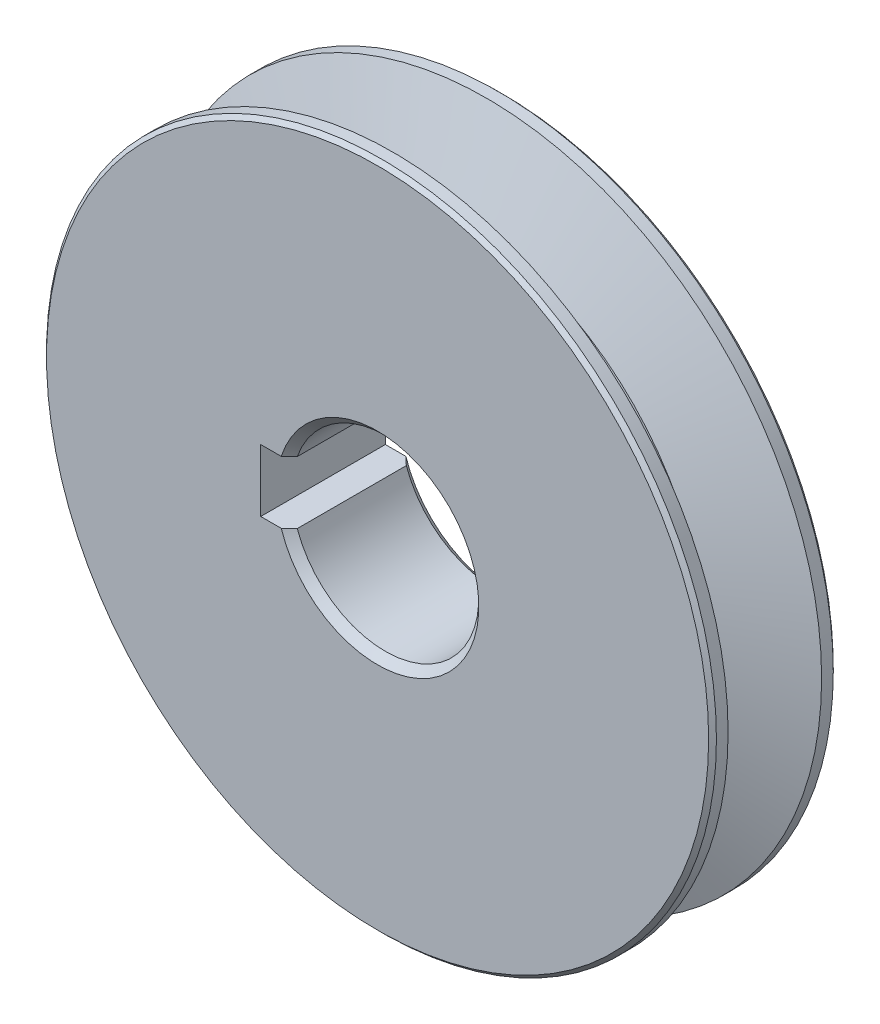
ISO-10303-21;
HEADER;
FILE_DESCRIPTION(('STEP AP214'),'2;1');
FILE_NAME('part.step','',(''),(''),'','','');
FILE_SCHEMA(('AUTOMOTIVE_DESIGN { 1 0 10303 214 1 1 1 1 }'));
ENDSEC;
DATA;
#1=APPLICATION_CONTEXT('core data for automotive mechanical design processes');
#2=APPLICATION_PROTOCOL_DEFINITION('international standard','automotive_design',2000,#1);
#3=PRODUCT_CONTEXT('',#1,'mechanical');
#4=PRODUCT('Part','Part','',(#3));
#5=PRODUCT_RELATED_PRODUCT_CATEGORY('part','',(#4));
#6=PRODUCT_DEFINITION_FORMATION('','',#4);
#7=PRODUCT_DEFINITION_CONTEXT('part definition',#1,'design');
#8=PRODUCT_DEFINITION('design','',#6,#7);
#9=PRODUCT_DEFINITION_SHAPE('','',#8);
#10=(LENGTH_UNIT() NAMED_UNIT(*) SI_UNIT(.MILLI.,.METRE.));
#11=(NAMED_UNIT(*) PLANE_ANGLE_UNIT() SI_UNIT($,.RADIAN.));
#12=(NAMED_UNIT(*) SI_UNIT($,.STERADIAN.) SOLID_ANGLE_UNIT());
#13=UNCERTAINTY_MEASURE_WITH_UNIT(LENGTH_MEASURE(1.E-05),#10,'distance_accuracy_value','');
#14=(GEOMETRIC_REPRESENTATION_CONTEXT(3) GLOBAL_UNCERTAINTY_ASSIGNED_CONTEXT((#13)) GLOBAL_UNIT_ASSIGNED_CONTEXT((#10,
#11,#12)) REPRESENTATION_CONTEXT('',''));
#15=CARTESIAN_POINT('',(0.,0.,0.));
#16=DIRECTION('',(0.,0.,1.));
#17=DIRECTION('',(1.,0.,0.));
#18=AXIS2_PLACEMENT_3D('',#15,#16,#17);
#19=CARTESIAN_POINT('',(0.0594454316027605,2.52282669934369E-12,-2.39999999999939));
#20=DIRECTION('',(0.,0.,1.));
#21=DIRECTION('',(1.,0.,0.));
#22=AXIS2_PLACEMENT_3D('',#19,#20,#21);
#23=CYLINDRICAL_SURFACE('',#22,12.9);
#24=CARTESIAN_POINT('',(0.0594454316027605,2.52282669934369E-12,-2.24999999999935));
#25=DIRECTION('',(0.,0.,-1.));
#26=DIRECTION('',(-1.,0.,0.));
#27=AXIS2_PLACEMENT_3D('',#24,#25,#26);
#28=CIRCLE('',#27,12.9);
#29=CARTESIAN_POINT('',(-12.8405545683972,2.52282669934369E-12,-2.24999999999935));
#30=VERTEX_POINT('',#29);
#31=EDGE_CURVE('E42',#30,#30,#28,.F.);
#32=ORIENTED_EDGE('',*,*,#31,.T.);
#33=EDGE_LOOP('',(#32));
#34=FACE_BOUND('',#33,.T.);
#35=CARTESIAN_POINT('',(0.0594454316027606,2.52282669934369E-12,-1.80110177307778));
#36=DIRECTION('',(0.,0.,1.));
#37=DIRECTION('',(1.,0.,0.));
#38=AXIS2_PLACEMENT_3D('',#35,#36,#37);
#39=CIRCLE('',#38,12.9);
#40=CARTESIAN_POINT('',(12.9594454316028,2.52282669934369E-12,-1.80110177307779));
#41=VERTEX_POINT('',#40);
#42=EDGE_CURVE('E120',#41,#41,#39,.T.);
#43=ORIENTED_EDGE('',*,*,#42,.F.);
#44=EDGE_LOOP('',(#43));
#45=FACE_BOUND('',#44,.T.);
#46=ADVANCED_FACE('F34',(#34,#45),#23,.T.);
#47=CARTESIAN_POINT('',(12.9594454316028,2.52282669934369E-12,-2.39999999999939));
#48=DIRECTION('',(0.,0.,-1.));
#49=DIRECTION('',(-1.,0.,0.));
#50=AXIS2_PLACEMENT_3D('',#47,#48,#49);
#51=PLANE('',#50);
#52=CARTESIAN_POINT('',(0.0594454316027605,2.52282669934369E-12,-2.39999999999939));
#53=DIRECTION('',(0.,0.,-1.));
#54=DIRECTION('',(-1.,0.,0.));
#55=AXIS2_PLACEMENT_3D('',#52,#53,#54);
#56=CIRCLE('',#55,12.75);
#57=CARTESIAN_POINT('',(-12.6905545683972,2.52282669934369E-12,-2.39999999999938));
#58=VERTEX_POINT('',#57);
#59=EDGE_CURVE('E11',#58,#58,#56,.T.);
#60=ORIENTED_EDGE('',*,*,#59,.T.);
#61=EDGE_LOOP('',(#60));
#62=FACE_BOUND('',#61,.T.);
#63=DIRECTION('',(1.,0.,0.));
#64=VECTOR('',#63,1.);
#65=CARTESIAN_POINT('',(-4.44055456839739,-1.19999999999748,-2.39999999999939));
#66=LINE('',#65,#64);
#67=CARTESIAN_POINT('',(-4.44055456839739,-1.19999999999748,-2.39999999999939));
#68=VERTEX_POINT('',#67);
#69=CARTESIAN_POINT('',(-3.65134963801083,-1.19999999999748,-2.39999999999939));
#70=VERTEX_POINT('',#69);
#71=EDGE_CURVE('E101',#68,#70,#66,.T.);
#72=ORIENTED_EDGE('',*,*,#71,.T.);
#73=CARTESIAN_POINT('',(0.0594454316026113,2.52282669934369E-12,-2.39999999999939));
#74=DIRECTION('',(0.,0.,-1.));
#75=DIRECTION('',(-1.,0.,0.));
#76=AXIS2_PLACEMENT_3D('',#73,#74,#75);
#77=CIRCLE('',#76,3.90000000623942);
#78=CARTESIAN_POINT('',(-3.65134963810726,1.19999999970432,-2.39999999999939));
#79=VERTEX_POINT('',#78);
#80=EDGE_CURVE('E180',#70,#79,#77,.F.);
#81=ORIENTED_EDGE('',*,*,#80,.T.);
#82=DIRECTION('',(-1.,0.,0.));
#83=VECTOR('',#82,1.);
#84=CARTESIAN_POINT('',(-3.33466711819825,1.19999999970432,-2.39999999999939));
#85=LINE('',#84,#83);
#86=CARTESIAN_POINT('',(-4.44055456839739,1.19999999970432,-2.39999999999939));
#87=VERTEX_POINT('',#86);
#88=EDGE_CURVE('E99',#79,#87,#85,.T.);
#89=ORIENTED_EDGE('',*,*,#88,.T.);
#90=DIRECTION('',(0.,-1.,0.));
#91=VECTOR('',#90,1.);
#92=CARTESIAN_POINT('',(-4.44055456839739,1.19999999970432,-2.39999999999939));
#93=LINE('',#92,#91);
#94=EDGE_CURVE('E95',#87,#68,#93,.T.);
#95=ORIENTED_EDGE('',*,*,#94,.T.);
#96=EDGE_LOOP('',(#72,#81,#89,#95));
#97=FACE_BOUND('',#96,.T.);
#98=ADVANCED_FACE('F107',(#62,#97),#51,.T.);
#99=CARTESIAN_POINT('',(0.0594454316027611,2.52282669934369E-12,2.40000000000061));
#100=DIRECTION('',(0.,0.,1.));
#101=DIRECTION('',(1.,0.,0.));
#102=AXIS2_PLACEMENT_3D('',#99,#100,#101);
#103=PLANE('',#102);
#104=CARTESIAN_POINT('',(0.0594454316027611,2.52282669934369E-12,2.40000000000061));
#105=DIRECTION('',(0.,0.,1.));
#106=DIRECTION('',(1.,0.,0.));
#107=AXIS2_PLACEMENT_3D('',#104,#105,#106);
#108=CIRCLE('',#107,12.75);
#109=CARTESIAN_POINT('',(12.8094454316027,2.52282669934369E-12,2.40000000000061));
#110=VERTEX_POINT('',#109);
#111=EDGE_CURVE('E327',#110,#110,#108,.T.);
#112=ORIENTED_EDGE('',*,*,#111,.T.);
#113=EDGE_LOOP('',(#112));
#114=FACE_BOUND('',#113,.T.);
#115=DIRECTION('',(-1.,0.,0.));
#116=VECTOR('',#115,1.);
#117=CARTESIAN_POINT('',(-3.33466711819825,1.19999999970432,2.40000000000061));
#118=LINE('',#117,#116);
#119=CARTESIAN_POINT('',(-3.65134963729901,1.19999999970432,2.40000000000061));
#120=VERTEX_POINT('',#119);
#121=CARTESIAN_POINT('',(-4.44055456839739,1.19999999970432,2.40000000000061));
#122=VERTEX_POINT('',#121);
#123=EDGE_CURVE('E110',#120,#122,#118,.T.);
#124=ORIENTED_EDGE('',*,*,#123,.F.);
#125=CARTESIAN_POINT('',(0.0594454316026113,2.52282669934369E-12,2.40000000000061));
#126=DIRECTION('',(0.,0.,1.));
#127=DIRECTION('',(1.,0.,0.));
#128=AXIS2_PLACEMENT_3D('',#125,#126,#127);
#129=CIRCLE('',#128,3.90000000547037);
#130=CARTESIAN_POINT('',(-3.65134963720257,-1.19999999999748,2.40000000000061));
#131=VERTEX_POINT('',#130);
#132=EDGE_CURVE('E57',#120,#131,#129,.F.);
#133=ORIENTED_EDGE('',*,*,#132,.T.);
#134=DIRECTION('',(1.,0.,0.));
#135=VECTOR('',#134,1.);
#136=CARTESIAN_POINT('',(-4.44055456839739,-1.19999999999748,2.40000000000061));
#137=LINE('',#136,#135);
#138=CARTESIAN_POINT('',(-4.44055456839739,-1.19999999999748,2.40000000000062));
#139=VERTEX_POINT('',#138);
#140=EDGE_CURVE('E112',#139,#131,#137,.T.);
#141=ORIENTED_EDGE('',*,*,#140,.F.);
#142=DIRECTION('',(0.,-1.,0.));
#143=VECTOR('',#142,1.);
#144=CARTESIAN_POINT('',(-4.44055456839739,1.19999999970432,2.40000000000061));
#145=LINE('',#144,#143);
#146=EDGE_CURVE('E97',#122,#139,#145,.T.);
#147=ORIENTED_EDGE('',*,*,#146,.F.);
#148=EDGE_LOOP('',(#124,#133,#141,#147));
#149=FACE_BOUND('',#148,.T.);
#150=ADVANCED_FACE('F193',(#114,#149),#103,.T.);
#151=CARTESIAN_POINT('',(0.0594454316027605,2.52282669934369E-12,-2.39999999999939));
#152=DIRECTION('',(0.,0.,1.));
#153=DIRECTION('',(1.,0.,0.));
#154=AXIS2_PLACEMENT_3D('',#151,#152,#153);
#155=CYLINDRICAL_SURFACE('',#154,12.9);
#156=CARTESIAN_POINT('',(0.0594454316027611,2.52282669934369E-12,2.25000000000063));
#157=DIRECTION('',(0.,0.,1.));
#158=DIRECTION('',(1.,0.,0.));
#159=AXIS2_PLACEMENT_3D('',#156,#157,#158);
#160=CIRCLE('',#159,12.9);
#161=CARTESIAN_POINT('',(12.9594454316028,2.52282669934369E-12,2.25000000000063));
#162=VERTEX_POINT('',#161);
#163=EDGE_CURVE('E325',#162,#162,#160,.F.);
#164=ORIENTED_EDGE('',*,*,#163,.T.);
#165=EDGE_LOOP('',(#164));
#166=FACE_BOUND('',#165,.T.);
#167=CARTESIAN_POINT('',(0.059445431602761,2.52282669934369E-12,1.80110177307902));
#168=DIRECTION('',(0.,0.,1.));
#169=DIRECTION('',(1.,0.,0.));
#170=AXIS2_PLACEMENT_3D('',#167,#168,#169);
#171=CIRCLE('',#170,12.9);
#172=CARTESIAN_POINT('',(12.9594454316028,2.52282669934369E-12,1.80110177307901));
#173=VERTEX_POINT('',#172);
#174=EDGE_CURVE('E134',#173,#173,#171,.T.);
#175=ORIENTED_EDGE('',*,*,#174,.T.);
#176=EDGE_LOOP('',(#175));
#177=FACE_BOUND('',#176,.T.);
#178=ADVANCED_FACE('F197',(#166,#177),#155,.T.);
#179=CARTESIAN_POINT('',(0.059445431602761,2.52282669934369E-12,1.80110177307902));
#180=DIRECTION('',(0.,0.,1.));
#181=DIRECTION('',(1.,0.,0.));
#182=AXIS2_PLACEMENT_3D('',#179,#180,#181);
#183=CONICAL_SURFACE('',#182,12.9,1.22173047639594);
#184=CARTESIAN_POINT('',(0.0594454316027609,2.52282669934369E-12,0.600000000000205));
#185=DIRECTION('',(0.,0.,1.));
#186=DIRECTION('',(1.,0.,0.));
#187=AXIS2_PLACEMENT_3D('',#184,#185,#186);
#188=CIRCLE('',#187,9.6);
#189=CARTESIAN_POINT('',(9.65944543160276,2.52282669934369E-12,0.600000000000203));
#190=VERTEX_POINT('',#189);
#191=EDGE_CURVE('E131',#190,#190,#188,.T.);
#192=ORIENTED_EDGE('',*,*,#191,.T.);
#193=EDGE_LOOP('',(#192));
#194=FACE_BOUND('',#193,.T.);
#195=ORIENTED_EDGE('',*,*,#174,.F.);
#196=EDGE_LOOP('',(#195));
#197=FACE_BOUND('',#196,.T.);
#198=ADVANCED_FACE('F201',(#194,#197),#183,.T.);
#199=CARTESIAN_POINT('',(0.0594454316027605,2.52282669934369E-12,-2.39999999999939));
#200=DIRECTION('',(0.,0.,1.));
#201=DIRECTION('',(1.,0.,0.));
#202=AXIS2_PLACEMENT_3D('',#199,#200,#201);
#203=CYLINDRICAL_SURFACE('',#202,9.6);
#204=CARTESIAN_POINT('',(0.0594454316027607,2.52282669934369E-12,-0.599999999999384));
#205=DIRECTION('',(0.,0.,1.));
#206=DIRECTION('',(1.,0.,0.));
#207=AXIS2_PLACEMENT_3D('',#204,#205,#206);
#208=CIRCLE('',#207,9.6);
#209=CARTESIAN_POINT('',(9.65944543160276,2.52282669934369E-12,-0.599999999999386));
#210=VERTEX_POINT('',#209);
#211=EDGE_CURVE('E128',#210,#210,#208,.T.);
#212=ORIENTED_EDGE('',*,*,#211,.T.);
#213=EDGE_LOOP('',(#212));
#214=FACE_BOUND('',#213,.T.);
#215=ORIENTED_EDGE('',*,*,#191,.F.);
#216=EDGE_LOOP('',(#215));
#217=FACE_BOUND('',#216,.T.);
#218=ADVANCED_FACE('F205',(#214,#217),#203,.T.);
#219=CARTESIAN_POINT('',(0.0594454316027607,2.52282669934369E-12,-0.599999999999384));
#220=DIRECTION('',(0.,0.,-1.));
#221=DIRECTION('',(-1.,0.,0.));
#222=AXIS2_PLACEMENT_3D('',#219,#220,#221);
#223=CONICAL_SURFACE('',#222,9.6,1.22173047639605);
#224=ORIENTED_EDGE('',*,*,#42,.T.);
#225=EDGE_LOOP('',(#224));
#226=FACE_BOUND('',#225,.T.);
#227=ORIENTED_EDGE('',*,*,#211,.F.);
#228=EDGE_LOOP('',(#227));
#229=FACE_BOUND('',#228,.T.);
#230=ADVANCED_FACE('F208',(#226,#229),#223,.T.);
#231=CARTESIAN_POINT('',(-4.44055456839739,1.19999999970432,-2.39999999999939));
#232=DIRECTION('',(-1.,0.,0.));
#233=DIRECTION('',(0.,0.,1.));
#234=AXIS2_PLACEMENT_3D('',#231,#232,#233);
#235=PLANE('',#234);
#236=ORIENTED_EDGE('',*,*,#146,.T.);
#237=DIRECTION('',(0.,0.,1.));
#238=VECTOR('',#237,1.);
#239=CARTESIAN_POINT('',(-4.44055456839739,-1.19999999999748,-2.39999999999939));
#240=LINE('',#239,#238);
#241=EDGE_CURVE('E91',#68,#139,#240,.T.);
#242=ORIENTED_EDGE('',*,*,#241,.F.);
#243=ORIENTED_EDGE('',*,*,#94,.F.);
#244=DIRECTION('',(0.,0.,1.));
#245=VECTOR('',#244,1.);
#246=CARTESIAN_POINT('',(-4.44055456839739,1.19999999970432,-2.39999999999939));
#247=LINE('',#246,#245);
#248=EDGE_CURVE('E118',#87,#122,#247,.T.);
#249=ORIENTED_EDGE('',*,*,#248,.T.);
#250=EDGE_LOOP('',(#236,#242,#243,#249));
#251=FACE_BOUND('',#250,.T.);
#252=ADVANCED_FACE('F92',(#251),#235,.F.);
#253=CARTESIAN_POINT('',(-3.33466711819825,1.19999999970432,-2.39999999999939));
#254=DIRECTION('',(0.,1.,0.));
#255=DIRECTION('',(0.,0.,1.));
#256=AXIS2_PLACEMENT_3D('',#253,#254,#255);
#257=PLANE('',#256);
#258=DIRECTION('',(0.,0.,1.));
#259=VECTOR('',#258,1.);
#260=CARTESIAN_POINT('',(-3.33466711819825,1.19999999970432,-2.39999999999939));
#261=LINE('',#260,#259);
#262=CARTESIAN_POINT('',(-3.33466711819825,1.19999999970432,-2.09999999452902));
#263=VERTEX_POINT('',#262);
#264=CARTESIAN_POINT('',(-3.33466711819825,1.19999999970432,2.0999999937612));
#265=VERTEX_POINT('',#264);
#266=EDGE_CURVE('E121',#263,#265,#261,.T.);
#267=ORIENTED_EDGE('',*,*,#266,.T.);
#268=CARTESIAN_POINT('',(-3.33466711819825,1.19999999970432,2.0999999937612));
#269=CARTESIAN_POINT('',(-3.38756168295526,1.19999999970432,2.14987950799116));
#270=CARTESIAN_POINT('',(-3.44039917663128,1.19999999970432,2.19981926693219));
#271=CARTESIAN_POINT('',(-3.54596001631963,1.19999999970432,2.29981926902455));
#272=CARTESIAN_POINT('',(-3.59868336234387,1.19999999970432,2.34987951216333));
#273=CARTESIAN_POINT('',(-3.65134963729901,1.19999999970432,2.40000000000062));
#274=B_SPLINE_CURVE_WITH_KNOTS('',3,(#268,#269,#270,#271,#272,#273),.UNSPECIFIED.,.F.,.F.,(4,2,
4),(0.,0.218110115192896,0.436220207650685),.UNSPECIFIED.);
#275=EDGE_CURVE('E149',#265,#120,#274,.T.);
#276=ORIENTED_EDGE('',*,*,#275,.T.);
#277=ORIENTED_EDGE('',*,*,#123,.T.);
#278=ORIENTED_EDGE('',*,*,#248,.F.);
#279=ORIENTED_EDGE('',*,*,#88,.F.);
#280=CARTESIAN_POINT('',(-3.65134963810726,1.19999999970432,-2.39999999999939));
#281=CARTESIAN_POINT('',(-3.59868336301735,1.19999999970432,-2.34987951228973));
#282=CARTESIAN_POINT('',(-3.54596001685837,1.19999999970432,-2.29981926927886));
#283=CARTESIAN_POINT('',(-3.44039917690059,1.19999999970432,-2.19981926744284));
#284=CARTESIAN_POINT('',(-3.3875616830899,1.19999999970432,-2.14987950863026));
#285=CARTESIAN_POINT('',(-3.33466711819825,1.19999999970432,-2.09999999452902));
#286=B_SPLINE_CURVE_WITH_KNOTS('',3,(#280,#281,#282,#283,#284,#285),.UNSPECIFIED.,.F.,.F.,(4,2,
4),(0.,0.218110092486728,0.436220207708565),.UNSPECIFIED.);
#287=EDGE_CURVE('E142',#79,#263,#286,.T.);
#288=ORIENTED_EDGE('',*,*,#287,.T.);
#289=EDGE_LOOP('',(#267,#276,#277,#278,#279,#288));
#290=FACE_BOUND('',#289,.T.);
#291=ADVANCED_FACE('F157',(#290),#257,.F.);
#292=CARTESIAN_POINT('',(-4.44055456839739,-1.19999999999748,-2.39999999999939));
#293=DIRECTION('',(0.,-1.,0.));
#294=DIRECTION('',(0.,0.,-1.));
#295=AXIS2_PLACEMENT_3D('',#292,#293,#294);
#296=PLANE('',#295);
#297=ORIENTED_EDGE('',*,*,#140,.T.);
#298=CARTESIAN_POINT('',(-3.65134963720257,-1.19999999999748,2.40000000000062));
#299=CARTESIAN_POINT('',(-3.598683362246,-1.19999999999748,2.34987951216326));
#300=CARTESIAN_POINT('',(-3.54596001622029,-1.19999999999748,2.29981926902445));
#301=CARTESIAN_POINT('',(-3.44039917652894,-1.19999999999748,2.19981926693208));
#302=CARTESIAN_POINT('',(-3.3875616828514,-1.19999999999748,2.14987950799109));
#303=CARTESIAN_POINT('',(-3.33466711809282,-1.19999999999748,2.0999999937612));
#304=B_SPLINE_CURVE_WITH_KNOTS('',3,(#298,#299,#300,#301,#302,#303),.UNSPECIFIED.,.F.,.F.,(4,2,
4),(0.,0.218110092461055,0.436220207657217),.UNSPECIFIED.);
#305=CARTESIAN_POINT('',(-3.33466711809282,-1.19999999999748,2.0999999937612));
#306=VERTEX_POINT('',#305);
#307=EDGE_CURVE('E175',#131,#306,#304,.T.);
#308=ORIENTED_EDGE('',*,*,#307,.T.);
#309=DIRECTION('',(0.,0.,1.));
#310=VECTOR('',#309,1.);
#311=CARTESIAN_POINT('',(-3.33466711809282,-1.19999999999748,-2.39999999999939));
#312=LINE('',#311,#310);
#313=CARTESIAN_POINT('',(-3.33466711809282,-1.19999999999748,-2.09999999452902));
#314=VERTEX_POINT('',#313);
#315=EDGE_CURVE('E98',#314,#306,#312,.T.);
#316=ORIENTED_EDGE('',*,*,#315,.F.);
#317=CARTESIAN_POINT('',(-3.33466711809282,-1.19999999999748,-2.09999999452902));
#318=CARTESIAN_POINT('',(-3.38756168298604,-1.19999999999748,-2.14987950863018));
#319=CARTESIAN_POINT('',(-3.44039917679826,-1.19999999999748,-2.19981926744273));
#320=CARTESIAN_POINT('',(-3.54596001675903,-1.19999999999748,-2.29981926927875));
#321=CARTESIAN_POINT('',(-3.59868336291948,-1.19999999999748,-2.34987951228966));
#322=CARTESIAN_POINT('',(-3.65134963801083,-1.19999999999748,-2.39999999999939));
#323=B_SPLINE_CURVE_WITH_KNOTS('',3,(#317,#318,#319,#320,#321,#322),.UNSPECIFIED.,.F.,.F.,(4,2,
4),(0.,0.218110115225102,0.436220207715097),.UNSPECIFIED.);
#324=EDGE_CURVE('E49',#314,#70,#323,.T.);
#325=ORIENTED_EDGE('',*,*,#324,.T.);
#326=ORIENTED_EDGE('',*,*,#71,.F.);
#327=ORIENTED_EDGE('',*,*,#241,.T.);
#328=EDGE_LOOP('',(#297,#308,#316,#325,#326,#327));
#329=FACE_BOUND('',#328,.T.);
#330=ADVANCED_FACE('F102',(#329),#296,.F.);
#331=CARTESIAN_POINT('',(0.0594454316026113,2.52282669934369E-12,-2.39999999999939));
#332=DIRECTION('',(0.,0.,1.));
#333=DIRECTION('',(1.,0.,0.));
#334=AXIS2_PLACEMENT_3D('',#331,#332,#333);
#335=CYLINDRICAL_SURFACE('',#334,3.6);
#336=ORIENTED_EDGE('',*,*,#315,.T.);
#337=CARTESIAN_POINT('',(0.0594454316026113,2.52282669934369E-12,2.0999999937612));
#338=DIRECTION('',(0.,0.,1.));
#339=DIRECTION('',(1.,0.,0.));
#340=AXIS2_PLACEMENT_3D('',#337,#338,#339);
#341=CIRCLE('',#340,3.6);
#342=EDGE_CURVE('E139',#306,#265,#341,.T.);
#343=ORIENTED_EDGE('',*,*,#342,.T.);
#344=ORIENTED_EDGE('',*,*,#266,.F.);
#345=CARTESIAN_POINT('',(0.0594454316026113,2.52282669934369E-12,-2.09999999452902));
#346=DIRECTION('',(0.,0.,-1.));
#347=DIRECTION('',(-1.,0.,0.));
#348=AXIS2_PLACEMENT_3D('',#345,#346,#347);
#349=CIRCLE('',#348,3.6);
#350=EDGE_CURVE('E137',#263,#314,#349,.T.);
#351=ORIENTED_EDGE('',*,*,#350,.T.);
#352=EDGE_LOOP('',(#336,#343,#344,#351));
#353=FACE_BOUND('',#352,.T.);
#354=ADVANCED_FACE('F163',(#353),#335,.F.);
#355=CARTESIAN_POINT('',(0.0594454316026113,2.52282669934369E-12,2.0999999937612));
#356=DIRECTION('',(0.,0.,1.));
#357=DIRECTION('',(1.,0.,0.));
#358=AXIS2_PLACEMENT_3D('',#355,#356,#357);
#359=CONICAL_SURFACE('',#358,3.6,0.785398162115705);
#360=ORIENTED_EDGE('',*,*,#307,.F.);
#361=ORIENTED_EDGE('',*,*,#132,.F.);
#362=ORIENTED_EDGE('',*,*,#275,.F.);
#363=ORIENTED_EDGE('',*,*,#342,.F.);
#364=EDGE_LOOP('',(#360,#361,#362,#363));
#365=FACE_BOUND('',#364,.T.);
#366=ADVANCED_FACE('F182',(#365),#359,.F.);
#367=CARTESIAN_POINT('',(0.0594454316026113,2.52282669934369E-12,-2.39999999999939));
#368=DIRECTION('',(0.,0.,-1.));
#369=DIRECTION('',(-1.,0.,0.));
#370=AXIS2_PLACEMENT_3D('',#367,#368,#369);
#371=CONICAL_SURFACE('',#370,3.90000000623942,0.785398164679191);
#372=ORIENTED_EDGE('',*,*,#324,.F.);
#373=ORIENTED_EDGE('',*,*,#350,.F.);
#374=ORIENTED_EDGE('',*,*,#287,.F.);
#375=ORIENTED_EDGE('',*,*,#80,.F.);
#376=EDGE_LOOP('',(#372,#373,#374,#375));
#377=FACE_BOUND('',#376,.T.);
#378=ADVANCED_FACE('F155',(#377),#371,.F.);
#379=CARTESIAN_POINT('',(0.0594454316027611,2.52282669934369E-12,2.40000000000061));
#380=DIRECTION('',(0.,0.,-1.));
#381=DIRECTION('',(-1.,0.,0.));
#382=AXIS2_PLACEMENT_3D('',#379,#380,#381);
#383=CONICAL_SURFACE('',#382,12.75,0.785398163397601);
#384=ORIENTED_EDGE('',*,*,#163,.F.);
#385=EDGE_LOOP('',(#384));
#386=FACE_BOUND('',#385,.T.);
#387=ORIENTED_EDGE('',*,*,#111,.F.);
#388=EDGE_LOOP('',(#387));
#389=FACE_BOUND('',#388,.T.);
#390=ADVANCED_FACE('F250',(#386,#389),#383,.T.);
#391=CARTESIAN_POINT('',(0.0594454316027605,2.52282669934369E-12,-2.24999999999935));
#392=DIRECTION('',(0.,0.,1.));
#393=DIRECTION('',(1.,0.,0.));
#394=AXIS2_PLACEMENT_3D('',#391,#392,#393);
#395=CONICAL_SURFACE('',#394,12.9,0.785398163397303);
#396=ORIENTED_EDGE('',*,*,#59,.F.);
#397=EDGE_LOOP('',(#396));
#398=FACE_BOUND('',#397,.T.);
#399=ORIENTED_EDGE('',*,*,#31,.F.);
#400=EDGE_LOOP('',(#399));
#401=FACE_BOUND('',#400,.T.);
#402=ADVANCED_FACE('F36',(#398,#401),#395,.T.);
#403=CLOSED_SHELL('',(#46,#98,#150,#178,#198,#218,#230,#252,#291,#330,#354,#366,#378,#390,#402));
#404=MANIFOLD_SOLID_BREP('B2',#403);
#405=ADVANCED_BREP_SHAPE_REPRESENTATION('',(#18,#404),#14);
#406=SHAPE_DEFINITION_REPRESENTATION(#9,#405);
ENDSEC;
END-ISO-10303-21;
